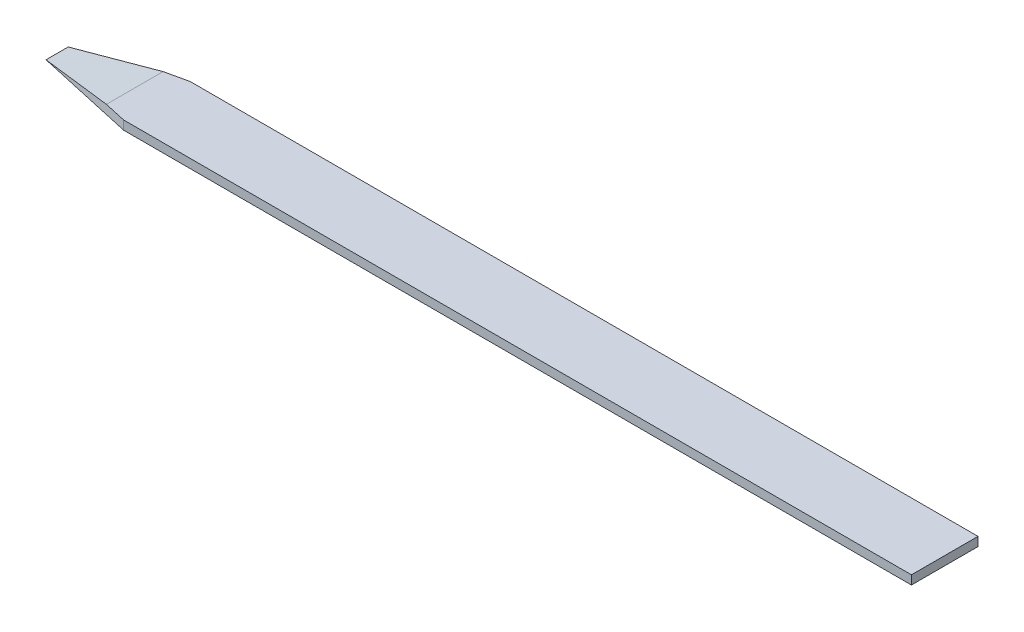
ISO-10303-21;
HEADER;
FILE_DESCRIPTION(('STEP AP214'),'2;1');
FILE_NAME('part.step','',(''),(''),'','','');
FILE_SCHEMA(('AUTOMOTIVE_DESIGN { 1 0 10303 214 1 1 1 1 }'));
ENDSEC;
DATA;
#1=APPLICATION_CONTEXT('core data for automotive mechanical design processes');
#2=APPLICATION_PROTOCOL_DEFINITION('international standard','automotive_design',2000,#1);
#3=PRODUCT_CONTEXT('',#1,'mechanical');
#4=PRODUCT('Part','Part','',(#3));
#5=PRODUCT_RELATED_PRODUCT_CATEGORY('part','',(#4));
#6=PRODUCT_DEFINITION_FORMATION('','',#4);
#7=PRODUCT_DEFINITION_CONTEXT('part definition',#1,'design');
#8=PRODUCT_DEFINITION('design','',#6,#7);
#9=PRODUCT_DEFINITION_SHAPE('','',#8);
#10=(LENGTH_UNIT() NAMED_UNIT(*) SI_UNIT(.MILLI.,.METRE.));
#11=(NAMED_UNIT(*) PLANE_ANGLE_UNIT() SI_UNIT($,.RADIAN.));
#12=(NAMED_UNIT(*) SI_UNIT($,.STERADIAN.) SOLID_ANGLE_UNIT());
#13=UNCERTAINTY_MEASURE_WITH_UNIT(LENGTH_MEASURE(1.E-05),#10,'distance_accuracy_value','');
#14=(GEOMETRIC_REPRESENTATION_CONTEXT(3) GLOBAL_UNCERTAINTY_ASSIGNED_CONTEXT((#13)) GLOBAL_UNIT_ASSIGNED_CONTEXT((#10,
#11,#12)) REPRESENTATION_CONTEXT('',''));
#15=CARTESIAN_POINT('',(0.,0.,0.));
#16=DIRECTION('',(0.,0.,1.));
#17=DIRECTION('',(1.,0.,0.));
#18=AXIS2_PLACEMENT_3D('',#15,#16,#17);
#19=CARTESIAN_POINT('',(0.,0.08,-0.35));
#20=DIRECTION('',(0.,0.,-1.));
#21=DIRECTION('',(-1.,0.,0.));
#22=AXIS2_PLACEMENT_3D('',#19,#20,#21);
#23=PLANE('',#22);
#24=DIRECTION('',(1.,0.,0.));
#25=VECTOR('',#24,1.);
#26=CARTESIAN_POINT('',(0.,0.,-0.35));
#27=LINE('',#26,#25);
#28=CARTESIAN_POINT('',(-7.1,0.,-0.35));
#29=VERTEX_POINT('',#28);
#30=CARTESIAN_POINT('',(0.,0.,-0.35));
#31=VERTEX_POINT('',#30);
#32=EDGE_CURVE('E112',#29,#31,#27,.T.);
#33=ORIENTED_EDGE('',*,*,#32,.F.);
#34=DIRECTION('',(0.,-1.,0.));
#35=VECTOR('',#34,1.);
#36=CARTESIAN_POINT('',(-7.1,0.08,-0.35));
#37=LINE('',#36,#35);
#38=CARTESIAN_POINT('',(-7.1,0.08,-0.35));
#39=VERTEX_POINT('',#38);
#40=EDGE_CURVE('E99',#39,#29,#37,.T.);
#41=ORIENTED_EDGE('',*,*,#40,.F.);
#42=DIRECTION('',(1.,0.,0.));
#43=VECTOR('',#42,1.);
#44=CARTESIAN_POINT('',(0.,0.08,-0.35));
#45=LINE('',#44,#43);
#46=CARTESIAN_POINT('',(0.,0.08,-0.35));
#47=VERTEX_POINT('',#46);
#48=EDGE_CURVE('E110',#39,#47,#45,.T.);
#49=ORIENTED_EDGE('',*,*,#48,.T.);
#50=DIRECTION('',(0.,-1.,0.));
#51=VECTOR('',#50,1.);
#52=CARTESIAN_POINT('',(0.,0.08,-0.35));
#53=LINE('',#52,#51);
#54=EDGE_CURVE('E136',#47,#31,#53,.T.);
#55=ORIENTED_EDGE('',*,*,#54,.T.);
#56=EDGE_LOOP('',(#33,#41,#49,#55));
#57=FACE_BOUND('',#56,.T.);
#58=ADVANCED_FACE('F43',(#57),#23,.T.);
#59=CARTESIAN_POINT('',(0.,0.08,0.));
#60=DIRECTION('',(0.,1.,0.));
#61=DIRECTION('',(0.,0.,1.));
#62=AXIS2_PLACEMENT_3D('',#59,#60,#61);
#63=PLANE('',#62);
#64=ORIENTED_EDGE('',*,*,#48,.F.);
#65=DIRECTION('',(0.976187060183953,0.,-0.216930457818656));
#66=VECTOR('',#65,1.);
#67=CARTESIAN_POINT('',(-8.,0.0800000000000005,-0.15));
#68=LINE('',#67,#66);
#69=CARTESIAN_POINT('',(-7.30000000000001,0.0799999999999995,-0.305555555555554));
#70=VERTEX_POINT('',#69);
#71=EDGE_CURVE('E96',#70,#39,#68,.T.);
#72=ORIENTED_EDGE('',*,*,#71,.F.);
#73=DIRECTION('',(0.,0.,1.));
#74=VECTOR('',#73,1.);
#75=CARTESIAN_POINT('',(-7.3,0.08,-0.35));
#76=LINE('',#75,#74);
#77=CARTESIAN_POINT('',(-7.3,0.08,0.205555555555555));
#78=VERTEX_POINT('',#77);
#79=EDGE_CURVE('E105',#70,#78,#76,.T.);
#80=ORIENTED_EDGE('',*,*,#79,.T.);
#81=DIRECTION('',(0.976187060183953,0.,0.216930457818656));
#82=VECTOR('',#81,1.);
#83=CARTESIAN_POINT('',(-8.,0.0799999999999995,0.0499999999999998));
#84=LINE('',#83,#82);
#85=CARTESIAN_POINT('',(-7.1,0.08,0.25));
#86=VERTEX_POINT('',#85);
#87=EDGE_CURVE('E68',#78,#86,#84,.T.);
#88=ORIENTED_EDGE('',*,*,#87,.T.);
#89=DIRECTION('',(1.,0.,0.));
#90=VECTOR('',#89,1.);
#91=CARTESIAN_POINT('',(0.,0.08,0.25));
#92=LINE('',#91,#90);
#93=CARTESIAN_POINT('',(0.,0.08,0.25));
#94=VERTEX_POINT('',#93);
#95=EDGE_CURVE('E46',#86,#94,#92,.T.);
#96=ORIENTED_EDGE('',*,*,#95,.T.);
#97=DIRECTION('',(0.,0.,1.));
#98=VECTOR('',#97,1.);
#99=CARTESIAN_POINT('',(0.,0.08,0.));
#100=LINE('',#99,#98);
#101=EDGE_CURVE('E118',#47,#94,#100,.T.);
#102=ORIENTED_EDGE('',*,*,#101,.F.);
#103=EDGE_LOOP('',(#64,#72,#80,#88,#96,#102));
#104=FACE_BOUND('',#103,.T.);
#105=ADVANCED_FACE('F116',(#104),#63,.T.);
#106=CARTESIAN_POINT('',(0.,0.,0.));
#107=DIRECTION('',(0.,1.,0.));
#108=DIRECTION('',(0.,0.,1.));
#109=AXIS2_PLACEMENT_3D('',#106,#107,#108);
#110=PLANE('',#109);
#111=DIRECTION('',(0.976187060183953,0.,-0.216930457818656));
#112=VECTOR('',#111,1.);
#113=CARTESIAN_POINT('',(-8.,0.,-0.15));
#114=LINE('',#113,#112);
#115=CARTESIAN_POINT('',(-8.,0.,-0.15));
#116=VERTEX_POINT('',#115);
#117=EDGE_CURVE('E61',#116,#29,#114,.T.);
#118=ORIENTED_EDGE('',*,*,#117,.T.);
#119=ORIENTED_EDGE('',*,*,#32,.T.);
#120=DIRECTION('',(0.,0.,1.));
#121=VECTOR('',#120,1.);
#122=CARTESIAN_POINT('',(0.,0.,0.));
#123=LINE('',#122,#121);
#124=CARTESIAN_POINT('',(0.,0.,0.25));
#125=VERTEX_POINT('',#124);
#126=EDGE_CURVE('E120',#31,#125,#123,.T.);
#127=ORIENTED_EDGE('',*,*,#126,.T.);
#128=DIRECTION('',(1.,0.,0.));
#129=VECTOR('',#128,1.);
#130=CARTESIAN_POINT('',(0.,0.,0.25));
#131=LINE('',#130,#129);
#132=CARTESIAN_POINT('',(-7.1,0.,0.25));
#133=VERTEX_POINT('',#132);
#134=EDGE_CURVE('E124',#133,#125,#131,.T.);
#135=ORIENTED_EDGE('',*,*,#134,.F.);
#136=DIRECTION('',(0.976187060183953,0.,0.216930457818656));
#137=VECTOR('',#136,1.);
#138=CARTESIAN_POINT('',(-8.,0.,0.0499999999999998));
#139=LINE('',#138,#137);
#140=CARTESIAN_POINT('',(-8.,0.,0.0499999999999998));
#141=VERTEX_POINT('',#140);
#142=EDGE_CURVE('E181',#141,#133,#139,.T.);
#143=ORIENTED_EDGE('',*,*,#142,.F.);
#144=DIRECTION('',(0.,0.,-1.));
#145=VECTOR('',#144,1.);
#146=CARTESIAN_POINT('',(-8.,0.,0.));
#147=LINE('',#146,#145);
#148=EDGE_CURVE('E142',#141,#116,#147,.T.);
#149=ORIENTED_EDGE('',*,*,#148,.T.);
#150=EDGE_LOOP('',(#118,#119,#127,#135,#143,#149));
#151=FACE_BOUND('',#150,.T.);
#152=ADVANCED_FACE('F164',(#151),#110,.F.);
#153=CARTESIAN_POINT('',(-7.3,0.08,-0.35));
#154=DIRECTION('',(-0.113546591160732,0.993532672656404,0.));
#155=DIRECTION('',(-0.993532672656404,-0.113546591160732,0.));
#156=AXIS2_PLACEMENT_3D('',#153,#154,#155);
#157=PLANE('',#156);
#158=ORIENTED_EDGE('',*,*,#79,.F.);
#159=DIRECTION('',(-0.97016809441248,-0.11087635364714,0.21559290986944));
#160=VECTOR('',#159,1.);
#161=CARTESIAN_POINT('',(-7.29070393944281,0.0810624069208222,-0.307621346790488));
#162=LINE('',#161,#160);
#163=EDGE_CURVE('E12',#70,#116,#162,.T.);
#164=ORIENTED_EDGE('',*,*,#163,.T.);
#165=ORIENTED_EDGE('',*,*,#148,.F.);
#166=DIRECTION('',(-0.97016809441248,-0.11087635364714,-0.21559290986944));
#167=VECTOR('',#166,1.);
#168=CARTESIAN_POINT('',(-7.41620075696493,0.0667199134897221,0.179733165118904));
#169=LINE('',#168,#167);
#170=EDGE_CURVE('E53',#78,#141,#169,.T.);
#171=ORIENTED_EDGE('',*,*,#170,.F.);
#172=EDGE_LOOP('',(#158,#164,#165,#171));
#173=FACE_BOUND('',#172,.T.);
#174=ADVANCED_FACE('F197',(#173),#157,.T.);
#175=CARTESIAN_POINT('',(0.,0.08,0.25));
#176=DIRECTION('',(0.,0.,-1.));
#177=DIRECTION('',(-1.,0.,0.));
#178=AXIS2_PLACEMENT_3D('',#175,#176,#177);
#179=PLANE('',#178);
#180=ORIENTED_EDGE('',*,*,#95,.F.);
#181=DIRECTION('',(0.,-1.,0.));
#182=VECTOR('',#181,1.);
#183=CARTESIAN_POINT('',(-7.1,0.08,0.25));
#184=LINE('',#183,#182);
#185=EDGE_CURVE('E176',#86,#133,#184,.T.);
#186=ORIENTED_EDGE('',*,*,#185,.T.);
#187=ORIENTED_EDGE('',*,*,#134,.T.);
#188=DIRECTION('',(0.,-1.,0.));
#189=VECTOR('',#188,1.);
#190=CARTESIAN_POINT('',(0.,0.08,0.25));
#191=LINE('',#190,#189);
#192=EDGE_CURVE('E149',#94,#125,#191,.T.);
#193=ORIENTED_EDGE('',*,*,#192,.F.);
#194=EDGE_LOOP('',(#180,#186,#187,#193));
#195=FACE_BOUND('',#194,.T.);
#196=ADVANCED_FACE('F192',(#195),#179,.F.);
#197=CARTESIAN_POINT('',(0.,0.08,0.));
#198=DIRECTION('',(1.,0.,0.));
#199=DIRECTION('',(0.,0.,-1.));
#200=AXIS2_PLACEMENT_3D('',#197,#198,#199);
#201=PLANE('',#200);
#202=ORIENTED_EDGE('',*,*,#126,.F.);
#203=ORIENTED_EDGE('',*,*,#54,.F.);
#204=ORIENTED_EDGE('',*,*,#101,.T.);
#205=ORIENTED_EDGE('',*,*,#192,.T.);
#206=EDGE_LOOP('',(#202,#203,#204,#205));
#207=FACE_BOUND('',#206,.T.);
#208=ADVANCED_FACE('F160',(#207),#201,.T.);
#209=CARTESIAN_POINT('',(-8.,0.0799999999999995,0.0499999999999998));
#210=DIRECTION('',(0.216930457818656,0.,-0.976187060183953));
#211=DIRECTION('',(-0.976187060183953,0.,-0.216930457818656));
#212=AXIS2_PLACEMENT_3D('',#209,#210,#211);
#213=PLANE('',#212);
#214=ORIENTED_EDGE('',*,*,#170,.T.);
#215=ORIENTED_EDGE('',*,*,#142,.T.);
#216=ORIENTED_EDGE('',*,*,#185,.F.);
#217=ORIENTED_EDGE('',*,*,#87,.F.);
#218=EDGE_LOOP('',(#214,#215,#216,#217));
#219=FACE_BOUND('',#218,.T.);
#220=ADVANCED_FACE('F193',(#219),#213,.F.);
#221=CARTESIAN_POINT('',(-8.,0.0800000000000005,-0.15));
#222=DIRECTION('',(-0.216930457818656,0.,-0.976187060183953));
#223=DIRECTION('',(-0.976187060183953,0.,0.216930457818656));
#224=AXIS2_PLACEMENT_3D('',#221,#222,#223);
#225=PLANE('',#224);
#226=ORIENTED_EDGE('',*,*,#71,.T.);
#227=ORIENTED_EDGE('',*,*,#40,.T.);
#228=ORIENTED_EDGE('',*,*,#117,.F.);
#229=ORIENTED_EDGE('',*,*,#163,.F.);
#230=EDGE_LOOP('',(#226,#227,#228,#229));
#231=FACE_BOUND('',#230,.T.);
#232=ADVANCED_FACE('F98',(#231),#225,.T.);
#233=CLOSED_SHELL('',(#58,#105,#152,#174,#196,#208,#220,#232));
#234=MANIFOLD_SOLID_BREP('B2',#233);
#235=ADVANCED_BREP_SHAPE_REPRESENTATION('',(#18,#234),#14);
#236=SHAPE_DEFINITION_REPRESENTATION(#9,#235);
ENDSEC;
END-ISO-10303-21;
